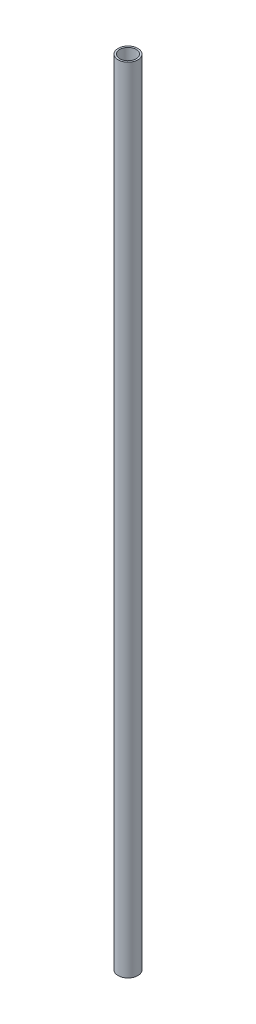
ISO-10303-21;
HEADER;
FILE_DESCRIPTION(('STEP AP214'),'2;1');
FILE_NAME('part.step','',(''),(''),'','','');
FILE_SCHEMA(('AUTOMOTIVE_DESIGN { 1 0 10303 214 1 1 1 1 }'));
ENDSEC;
DATA;
#1=APPLICATION_CONTEXT('core data for automotive mechanical design processes');
#2=APPLICATION_PROTOCOL_DEFINITION('international standard','automotive_design',2000,#1);
#3=PRODUCT_CONTEXT('',#1,'mechanical');
#4=PRODUCT('Part','Part','',(#3));
#5=PRODUCT_RELATED_PRODUCT_CATEGORY('part','',(#4));
#6=PRODUCT_DEFINITION_FORMATION('','',#4);
#7=PRODUCT_DEFINITION_CONTEXT('part definition',#1,'design');
#8=PRODUCT_DEFINITION('design','',#6,#7);
#9=PRODUCT_DEFINITION_SHAPE('','',#8);
#10=(LENGTH_UNIT() NAMED_UNIT(*) SI_UNIT(.MILLI.,.METRE.));
#11=(NAMED_UNIT(*) PLANE_ANGLE_UNIT() SI_UNIT($,.RADIAN.));
#12=(NAMED_UNIT(*) SI_UNIT($,.STERADIAN.) SOLID_ANGLE_UNIT());
#13=UNCERTAINTY_MEASURE_WITH_UNIT(LENGTH_MEASURE(1.E-05),#10,'distance_accuracy_value','');
#14=(GEOMETRIC_REPRESENTATION_CONTEXT(3) GLOBAL_UNCERTAINTY_ASSIGNED_CONTEXT((#13)) GLOBAL_UNIT_ASSIGNED_CONTEXT((#10,
#11,#12)) REPRESENTATION_CONTEXT('',''));
#15=CARTESIAN_POINT('',(0.,0.,0.));
#16=DIRECTION('',(0.,0.,1.));
#17=DIRECTION('',(1.,0.,0.));
#18=AXIS2_PLACEMENT_3D('',#15,#16,#17);
#19=CARTESIAN_POINT('',(0.,340.,0.));
#20=DIRECTION('',(0.,-1.,0.));
#21=DIRECTION('',(0.,0.,-1.));
#22=AXIS2_PLACEMENT_3D('',#19,#20,#21);
#23=CYLINDRICAL_SURFACE('',#22,4.25);
#24=CARTESIAN_POINT('',(0.,340.,0.));
#25=DIRECTION('',(0.,1.,0.));
#26=DIRECTION('',(0.,0.,1.));
#27=AXIS2_PLACEMENT_3D('',#24,#25,#26);
#28=CIRCLE('',#27,4.25);
#29=CARTESIAN_POINT('',(0.,340.,4.25));
#30=VERTEX_POINT('',#29);
#31=EDGE_CURVE('E10',#30,#30,#28,.T.);
#32=ORIENTED_EDGE('',*,*,#31,.F.);
#33=EDGE_LOOP('',(#32));
#34=FACE_BOUND('',#33,.T.);
#35=CARTESIAN_POINT('',(0.,0.,0.));
#36=DIRECTION('',(0.,1.,0.));
#37=DIRECTION('',(0.,0.,1.));
#38=AXIS2_PLACEMENT_3D('',#35,#36,#37);
#39=CIRCLE('',#38,4.25);
#40=CARTESIAN_POINT('',(0.,0.,4.25));
#41=VERTEX_POINT('',#40);
#42=EDGE_CURVE('E40',#41,#41,#39,.T.);
#43=ORIENTED_EDGE('',*,*,#42,.T.);
#44=EDGE_LOOP('',(#43));
#45=FACE_BOUND('',#44,.T.);
#46=ADVANCED_FACE('F37',(#34,#45),#23,.T.);
#47=CARTESIAN_POINT('',(0.,340.,0.));
#48=DIRECTION('',(0.,1.,0.));
#49=DIRECTION('',(0.,0.,1.));
#50=AXIS2_PLACEMENT_3D('',#47,#48,#49);
#51=PLANE('',#50);
#52=CARTESIAN_POINT('',(0.,340.,0.));
#53=DIRECTION('',(0.,1.,0.));
#54=DIRECTION('',(0.,0.,1.));
#55=AXIS2_PLACEMENT_3D('',#52,#53,#54);
#56=CIRCLE('',#55,3.5);
#57=CARTESIAN_POINT('',(0.,340.,3.5));
#58=VERTEX_POINT('',#57);
#59=EDGE_CURVE('E49',#58,#58,#56,.F.);
#60=ORIENTED_EDGE('',*,*,#59,.T.);
#61=EDGE_LOOP('',(#60));
#62=FACE_BOUND('',#61,.T.);
#63=ORIENTED_EDGE('',*,*,#31,.T.);
#64=EDGE_LOOP('',(#63));
#65=FACE_BOUND('',#64,.T.);
#66=ADVANCED_FACE('F69',(#62,#65),#51,.T.);
#67=CARTESIAN_POINT('',(0.,0.,0.));
#68=DIRECTION('',(0.,1.,0.));
#69=DIRECTION('',(0.,0.,1.));
#70=AXIS2_PLACEMENT_3D('',#67,#68,#69);
#71=PLANE('',#70);
#72=CARTESIAN_POINT('',(0.,0.,0.));
#73=DIRECTION('',(0.,1.,0.));
#74=DIRECTION('',(0.,0.,1.));
#75=AXIS2_PLACEMENT_3D('',#72,#73,#74);
#76=CIRCLE('',#75,3.5);
#77=CARTESIAN_POINT('',(0.,0.,3.5));
#78=VERTEX_POINT('',#77);
#79=EDGE_CURVE('E54',#78,#78,#76,.T.);
#80=ORIENTED_EDGE('',*,*,#79,.T.);
#81=EDGE_LOOP('',(#80));
#82=FACE_BOUND('',#81,.T.);
#83=ORIENTED_EDGE('',*,*,#42,.F.);
#84=EDGE_LOOP('',(#83));
#85=FACE_BOUND('',#84,.T.);
#86=ADVANCED_FACE('F59',(#82,#85),#71,.F.);
#87=CARTESIAN_POINT('',(0.,494.,0.));
#88=DIRECTION('',(0.,-1.,0.));
#89=DIRECTION('',(0.,0.,-1.));
#90=AXIS2_PLACEMENT_3D('',#87,#88,#89);
#91=CYLINDRICAL_SURFACE('',#90,3.5);
#92=ORIENTED_EDGE('',*,*,#59,.F.);
#93=EDGE_LOOP('',(#92));
#94=FACE_BOUND('',#93,.T.);
#95=ORIENTED_EDGE('',*,*,#79,.F.);
#96=EDGE_LOOP('',(#95));
#97=FACE_BOUND('',#96,.T.);
#98=ADVANCED_FACE('F62',(#94,#97),#91,.F.);
#99=CLOSED_SHELL('',(#46,#66,#86,#98));
#100=MANIFOLD_SOLID_BREP('B2',#99);
#101=ADVANCED_BREP_SHAPE_REPRESENTATION('',(#18,#100),#14);
#102=SHAPE_DEFINITION_REPRESENTATION(#9,#101);
ENDSEC;
END-ISO-10303-21;
